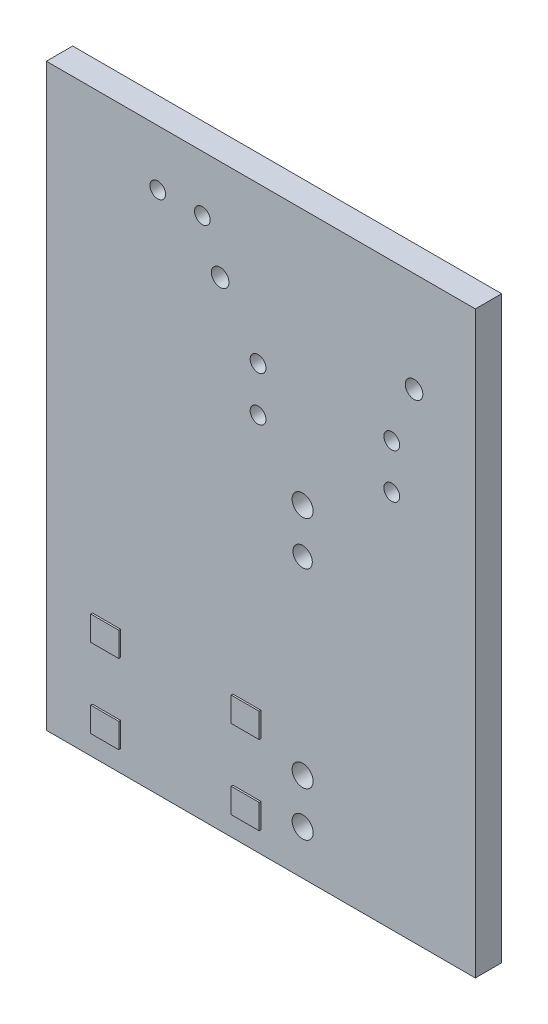
ISO-10303-21;
HEADER;
FILE_DESCRIPTION(('STEP AP214'),'2;1');
FILE_NAME('part.step','',(''),(''),'','','');
FILE_SCHEMA(('AUTOMOTIVE_DESIGN { 1 0 10303 214 1 1 1 1 }'));
ENDSEC;
DATA;
#1=APPLICATION_CONTEXT('core data for automotive mechanical design processes');
#2=APPLICATION_PROTOCOL_DEFINITION('international standard','automotive_design',2000,#1);
#3=PRODUCT_CONTEXT('',#1,'mechanical');
#4=PRODUCT('Part','Part','',(#3));
#5=PRODUCT_RELATED_PRODUCT_CATEGORY('part','',(#4));
#6=PRODUCT_DEFINITION_FORMATION('','',#4);
#7=PRODUCT_DEFINITION_CONTEXT('part definition',#1,'design');
#8=PRODUCT_DEFINITION('design','',#6,#7);
#9=PRODUCT_DEFINITION_SHAPE('','',#8);
#10=(LENGTH_UNIT() NAMED_UNIT(*) SI_UNIT(.MILLI.,.METRE.));
#11=(NAMED_UNIT(*) PLANE_ANGLE_UNIT() SI_UNIT($,.RADIAN.));
#12=(NAMED_UNIT(*) SI_UNIT($,.STERADIAN.) SOLID_ANGLE_UNIT());
#13=UNCERTAINTY_MEASURE_WITH_UNIT(LENGTH_MEASURE(1.E-05),#10,'distance_accuracy_value','');
#14=(GEOMETRIC_REPRESENTATION_CONTEXT(3) GLOBAL_UNCERTAINTY_ASSIGNED_CONTEXT((#13)) GLOBAL_UNIT_ASSIGNED_CONTEXT((#10,
#11,#12)) REPRESENTATION_CONTEXT('',''));
#15=CARTESIAN_POINT('',(0.,0.,0.));
#16=DIRECTION('',(0.,0.,1.));
#17=DIRECTION('',(1.,0.,0.));
#18=AXIS2_PLACEMENT_3D('',#15,#16,#17);
#19=CARTESIAN_POINT('',(0.,0.,1.5));
#20=DIRECTION('',(0.,0.,1.));
#21=DIRECTION('',(1.,0.,0.));
#22=AXIS2_PLACEMENT_3D('',#19,#20,#21);
#23=PLANE('',#22);
#24=CARTESIAN_POINT('',(19.685,21.59,1.5));
#25=DIRECTION('',(0.,0.,1.));
#26=DIRECTION('',(1.,0.,0.));
#27=AXIS2_PLACEMENT_3D('',#24,#25,#26);
#28=CIRCLE('',#27,0.449580000000002);
#29=CARTESIAN_POINT('',(20.13458,21.59,1.5));
#30=VERTEX_POINT('',#29);
#31=EDGE_CURVE('E314',#30,#30,#28,.T.);
#32=ORIENTED_EDGE('',*,*,#31,.F.);
#33=EDGE_LOOP('',(#32));
#34=FACE_BOUND('',#33,.T.);
#35=CARTESIAN_POINT('',(19.685,24.13,1.5));
#36=DIRECTION('',(0.,0.,1.));
#37=DIRECTION('',(1.,0.,0.));
#38=AXIS2_PLACEMENT_3D('',#35,#36,#37);
#39=CIRCLE('',#38,0.449580000000002);
#40=CARTESIAN_POINT('',(20.13458,24.13,1.5));
#41=VERTEX_POINT('',#40);
#42=EDGE_CURVE('E317',#41,#41,#39,.T.);
#43=ORIENTED_EDGE('',*,*,#42,.F.);
#44=EDGE_LOOP('',(#43));
#45=FACE_BOUND('',#44,.T.);
#46=CARTESIAN_POINT('',(12.065,24.13,1.5));
#47=DIRECTION('',(0.,0.,1.));
#48=DIRECTION('',(1.,0.,0.));
#49=AXIS2_PLACEMENT_3D('',#46,#47,#48);
#50=CIRCLE('',#49,0.44958);
#51=CARTESIAN_POINT('',(12.51458,24.13,1.5));
#52=VERTEX_POINT('',#51);
#53=EDGE_CURVE('E321',#52,#52,#50,.T.);
#54=ORIENTED_EDGE('',*,*,#53,.F.);
#55=EDGE_LOOP('',(#54));
#56=FACE_BOUND('',#55,.T.);
#57=CARTESIAN_POINT('',(12.065,21.59,1.5));
#58=DIRECTION('',(0.,0.,1.));
#59=DIRECTION('',(1.,0.,0.));
#60=AXIS2_PLACEMENT_3D('',#57,#58,#59);
#61=CIRCLE('',#60,0.44958);
#62=CARTESIAN_POINT('',(12.51458,21.59,1.5));
#63=VERTEX_POINT('',#62);
#64=EDGE_CURVE('E324',#63,#63,#61,.T.);
#65=ORIENTED_EDGE('',*,*,#64,.F.);
#66=EDGE_LOOP('',(#65));
#67=FACE_BOUND('',#66,.T.);
#68=CARTESIAN_POINT('',(14.605,15.875,1.5));
#69=DIRECTION('',(0.,0.,1.));
#70=DIRECTION('',(1.,0.,0.));
#71=AXIS2_PLACEMENT_3D('',#68,#69,#70);
#72=CIRCLE('',#71,0.55118);
#73=CARTESIAN_POINT('',(15.15618,15.875,1.5));
#74=VERTEX_POINT('',#73);
#75=EDGE_CURVE('E327',#74,#74,#72,.T.);
#76=ORIENTED_EDGE('',*,*,#75,.F.);
#77=EDGE_LOOP('',(#76));
#78=FACE_BOUND('',#77,.T.);
#79=CARTESIAN_POINT('',(14.605,18.415,1.5));
#80=DIRECTION('',(0.,0.,1.));
#81=DIRECTION('',(1.,0.,0.));
#82=AXIS2_PLACEMENT_3D('',#79,#80,#81);
#83=CIRCLE('',#82,0.59944);
#84=CARTESIAN_POINT('',(15.20444,18.415,1.5));
#85=VERTEX_POINT('',#84);
#86=EDGE_CURVE('E330',#85,#85,#83,.T.);
#87=ORIENTED_EDGE('',*,*,#86,.F.);
#88=EDGE_LOOP('',(#87));
#89=FACE_BOUND('',#88,.T.);
#90=CARTESIAN_POINT('',(14.605,2.54,1.5));
#91=DIRECTION('',(0.,0.,1.));
#92=DIRECTION('',(1.,0.,0.));
#93=AXIS2_PLACEMENT_3D('',#90,#91,#92);
#94=CIRCLE('',#93,0.59944);
#95=CARTESIAN_POINT('',(15.20444,2.54,1.5));
#96=VERTEX_POINT('',#95);
#97=EDGE_CURVE('E333',#96,#96,#94,.T.);
#98=ORIENTED_EDGE('',*,*,#97,.F.);
#99=EDGE_LOOP('',(#98));
#100=FACE_BOUND('',#99,.T.);
#101=CARTESIAN_POINT('',(14.605,5.08,1.5));
#102=DIRECTION('',(0.,0.,1.));
#103=DIRECTION('',(1.,0.,0.));
#104=AXIS2_PLACEMENT_3D('',#101,#102,#103);
#105=CIRCLE('',#104,0.59944);
#106=CARTESIAN_POINT('',(15.20444,5.08,1.5));
#107=VERTEX_POINT('',#106);
#108=EDGE_CURVE('E336',#107,#107,#105,.T.);
#109=ORIENTED_EDGE('',*,*,#108,.F.);
#110=EDGE_LOOP('',(#109));
#111=FACE_BOUND('',#110,.T.);
#112=CARTESIAN_POINT('',(9.906,27.305,1.5));
#113=DIRECTION('',(0.,0.,1.));
#114=DIRECTION('',(1.,0.,0.));
#115=AXIS2_PLACEMENT_3D('',#112,#113,#114);
#116=CIRCLE('',#115,0.50038);
#117=CARTESIAN_POINT('',(10.40638,27.305,1.5));
#118=VERTEX_POINT('',#117);
#119=EDGE_CURVE('E339',#118,#118,#116,.T.);
#120=ORIENTED_EDGE('',*,*,#119,.F.);
#121=EDGE_LOOP('',(#120));
#122=FACE_BOUND('',#121,.T.);
#123=CARTESIAN_POINT('',(20.955,27.305,1.5));
#124=DIRECTION('',(0.,0.,1.));
#125=DIRECTION('',(1.,0.,0.));
#126=AXIS2_PLACEMENT_3D('',#123,#124,#125);
#127=CIRCLE('',#126,0.500379999999998);
#128=CARTESIAN_POINT('',(21.45538,27.305,1.5));
#129=VERTEX_POINT('',#128);
#130=EDGE_CURVE('E342',#129,#129,#127,.T.);
#131=ORIENTED_EDGE('',*,*,#130,.F.);
#132=EDGE_LOOP('',(#131));
#133=FACE_BOUND('',#132,.T.);
#134=CARTESIAN_POINT('',(8.89,29.845,1.5));
#135=DIRECTION('',(0.,0.,1.));
#136=DIRECTION('',(1.,0.,0.));
#137=AXIS2_PLACEMENT_3D('',#134,#135,#136);
#138=CIRCLE('',#137,0.4445);
#139=CARTESIAN_POINT('',(9.3345,29.845,1.5));
#140=VERTEX_POINT('',#139);
#141=EDGE_CURVE('E345',#140,#140,#138,.T.);
#142=ORIENTED_EDGE('',*,*,#141,.F.);
#143=EDGE_LOOP('',(#142));
#144=FACE_BOUND('',#143,.T.);
#145=CARTESIAN_POINT('',(6.35,29.845,1.5));
#146=DIRECTION('',(0.,0.,1.));
#147=DIRECTION('',(1.,0.,0.));
#148=AXIS2_PLACEMENT_3D('',#145,#146,#147);
#149=CIRCLE('',#148,0.4445);
#150=CARTESIAN_POINT('',(6.7945,29.845,1.5));
#151=VERTEX_POINT('',#150);
#152=EDGE_CURVE('E348',#151,#151,#149,.T.);
#153=ORIENTED_EDGE('',*,*,#152,.F.);
#154=EDGE_LOOP('',(#153));
#155=FACE_BOUND('',#154,.T.);
#156=DIRECTION('',(-1.,0.,0.));
#157=VECTOR('',#156,1.);
#158=CARTESIAN_POINT('',(0.,33.02,1.5));
#159=LINE('',#158,#157);
#160=CARTESIAN_POINT('',(24.4475,33.02,1.5));
#161=VERTEX_POINT('',#160);
#162=CARTESIAN_POINT('',(0.,33.02,1.5));
#163=VERTEX_POINT('',#162);
#164=EDGE_CURVE('E351',#161,#163,#159,.T.);
#165=ORIENTED_EDGE('',*,*,#164,.T.);
#166=DIRECTION('',(0.,-1.,0.));
#167=VECTOR('',#166,1.);
#168=CARTESIAN_POINT('',(0.,0.,1.5));
#169=LINE('',#168,#167);
#170=CARTESIAN_POINT('',(0.,0.,1.5));
#171=VERTEX_POINT('',#170);
#172=EDGE_CURVE('E354',#163,#171,#169,.T.);
#173=ORIENTED_EDGE('',*,*,#172,.T.);
#174=DIRECTION('',(1.,0.,0.));
#175=VECTOR('',#174,1.);
#176=CARTESIAN_POINT('',(0.,0.,1.5));
#177=LINE('',#176,#175);
#178=CARTESIAN_POINT('',(24.4475,0.,1.5));
#179=VERTEX_POINT('',#178);
#180=EDGE_CURVE('E356',#171,#179,#177,.T.);
#181=ORIENTED_EDGE('',*,*,#180,.T.);
#182=DIRECTION('',(0.,1.,0.));
#183=VECTOR('',#182,1.);
#184=CARTESIAN_POINT('',(24.4475,0.,1.5));
#185=LINE('',#184,#183);
#186=EDGE_CURVE('E358',#179,#161,#185,.T.);
#187=ORIENTED_EDGE('',*,*,#186,.T.);
#188=EDGE_LOOP('',(#165,#173,#181,#187));
#189=FACE_BOUND('',#188,.T.);
#190=DIRECTION('',(1.,0.,0.));
#191=VECTOR('',#190,1.);
#192=CARTESIAN_POINT('',(2.6289,1.20396,1.5));
#193=LINE('',#192,#191);
#194=CARTESIAN_POINT('',(2.6289,1.20396,1.5));
#195=VERTEX_POINT('',#194);
#196=CARTESIAN_POINT('',(4.2291,1.20396,1.5));
#197=VERTEX_POINT('',#196);
#198=EDGE_CURVE('E296',#195,#197,#193,.T.);
#199=ORIENTED_EDGE('',*,*,#198,.F.);
#200=DIRECTION('',(0.,-1.,0.));
#201=VECTOR('',#200,1.);
#202=CARTESIAN_POINT('',(2.6289,2.60604,1.5));
#203=LINE('',#202,#201);
#204=CARTESIAN_POINT('',(2.6289,2.60604,1.5));
#205=VERTEX_POINT('',#204);
#206=EDGE_CURVE('E271',#205,#195,#203,.T.);
#207=ORIENTED_EDGE('',*,*,#206,.F.);
#208=DIRECTION('',(1.,0.,0.));
#209=VECTOR('',#208,1.);
#210=CARTESIAN_POINT('',(2.6289,2.60604,1.5));
#211=LINE('',#210,#209);
#212=CARTESIAN_POINT('',(4.2291,2.60604,1.5));
#213=VERTEX_POINT('',#212);
#214=EDGE_CURVE('E285',#205,#213,#211,.T.);
#215=ORIENTED_EDGE('',*,*,#214,.T.);
#216=DIRECTION('',(0.,-1.,0.));
#217=VECTOR('',#216,1.);
#218=CARTESIAN_POINT('',(4.2291,2.60604,1.5));
#219=LINE('',#218,#217);
#220=EDGE_CURVE('E299',#213,#197,#219,.T.);
#221=ORIENTED_EDGE('',*,*,#220,.T.);
#222=EDGE_LOOP('',(#199,#207,#215,#221));
#223=FACE_BOUND('',#222,.T.);
#224=DIRECTION('',(1.,0.,0.));
#225=VECTOR('',#224,1.);
#226=CARTESIAN_POINT('',(2.6289,5.70484,1.5));
#227=LINE('',#226,#225);
#228=CARTESIAN_POINT('',(2.6289,5.70484,1.5));
#229=VERTEX_POINT('',#228);
#230=CARTESIAN_POINT('',(4.2291,5.70484,1.5));
#231=VERTEX_POINT('',#230);
#232=EDGE_CURVE('E265',#229,#231,#227,.T.);
#233=ORIENTED_EDGE('',*,*,#232,.F.);
#234=DIRECTION('',(0.,-1.,0.));
#235=VECTOR('',#234,1.);
#236=CARTESIAN_POINT('',(2.6289,7.10438,1.5));
#237=LINE('',#236,#235);
#238=CARTESIAN_POINT('',(2.6289,7.10438,1.5));
#239=VERTEX_POINT('',#238);
#240=EDGE_CURVE('E268',#239,#229,#237,.T.);
#241=ORIENTED_EDGE('',*,*,#240,.F.);
#242=DIRECTION('',(1.,0.,0.));
#243=VECTOR('',#242,1.);
#244=CARTESIAN_POINT('',(2.6289,7.10438,1.5));
#245=LINE('',#244,#243);
#246=CARTESIAN_POINT('',(4.2291,7.10438,1.5));
#247=VERTEX_POINT('',#246);
#248=EDGE_CURVE('E260',#239,#247,#245,.T.);
#249=ORIENTED_EDGE('',*,*,#248,.T.);
#250=DIRECTION('',(0.,-1.,0.));
#251=VECTOR('',#250,1.);
#252=CARTESIAN_POINT('',(4.2291,7.10438,1.5));
#253=LINE('',#252,#251);
#254=EDGE_CURVE('E262',#247,#231,#253,.T.);
#255=ORIENTED_EDGE('',*,*,#254,.T.);
#256=EDGE_LOOP('',(#233,#241,#249,#255));
#257=FACE_BOUND('',#256,.T.);
#258=DIRECTION('',(1.,0.,0.));
#259=VECTOR('',#258,1.);
#260=CARTESIAN_POINT('',(10.6299,5.70484,1.5));
#261=LINE('',#260,#259);
#262=CARTESIAN_POINT('',(10.6299,5.70484,1.5));
#263=VERTEX_POINT('',#262);
#264=CARTESIAN_POINT('',(12.2301,5.70484,1.5));
#265=VERTEX_POINT('',#264);
#266=EDGE_CURVE('E232',#263,#265,#261,.T.);
#267=ORIENTED_EDGE('',*,*,#266,.F.);
#268=DIRECTION('',(0.,-1.,0.));
#269=VECTOR('',#268,1.);
#270=CARTESIAN_POINT('',(10.6299,7.10438,1.5));
#271=LINE('',#270,#269);
#272=CARTESIAN_POINT('',(10.6299,7.10438,1.5));
#273=VERTEX_POINT('',#272);
#274=EDGE_CURVE('E235',#273,#263,#271,.T.);
#275=ORIENTED_EDGE('',*,*,#274,.F.);
#276=DIRECTION('',(1.,0.,0.));
#277=VECTOR('',#276,1.);
#278=CARTESIAN_POINT('',(10.6299,7.10438,1.5));
#279=LINE('',#278,#277);
#280=CARTESIAN_POINT('',(12.2301,7.10438,1.5));
#281=VERTEX_POINT('',#280);
#282=EDGE_CURVE('E227',#273,#281,#279,.T.);
#283=ORIENTED_EDGE('',*,*,#282,.T.);
#284=DIRECTION('',(0.,-1.,0.));
#285=VECTOR('',#284,1.);
#286=CARTESIAN_POINT('',(12.2301,7.10438,1.5));
#287=LINE('',#286,#285);
#288=EDGE_CURVE('E229',#281,#265,#287,.T.);
#289=ORIENTED_EDGE('',*,*,#288,.T.);
#290=EDGE_LOOP('',(#267,#275,#283,#289));
#291=FACE_BOUND('',#290,.T.);
#292=DIRECTION('',(1.,0.,0.));
#293=VECTOR('',#292,1.);
#294=CARTESIAN_POINT('',(10.6299,1.20396,1.5));
#295=LINE('',#294,#293);
#296=CARTESIAN_POINT('',(10.6299,1.20396,1.5));
#297=VERTEX_POINT('',#296);
#298=CARTESIAN_POINT('',(12.2301,1.20396,1.5));
#299=VERTEX_POINT('',#298);
#300=EDGE_CURVE('E63',#297,#299,#295,.T.);
#301=ORIENTED_EDGE('',*,*,#300,.F.);
#302=DIRECTION('',(0.,-1.,0.));
#303=VECTOR('',#302,1.);
#304=CARTESIAN_POINT('',(10.6299,2.60604,1.5));
#305=LINE('',#304,#303);
#306=CARTESIAN_POINT('',(10.6299,2.60604,1.5));
#307=VERTEX_POINT('',#306);
#308=EDGE_CURVE('E182',#307,#297,#305,.T.);
#309=ORIENTED_EDGE('',*,*,#308,.F.);
#310=DIRECTION('',(1.,0.,0.));
#311=VECTOR('',#310,1.);
#312=CARTESIAN_POINT('',(10.6299,2.60604,1.5));
#313=LINE('',#312,#311);
#314=CARTESIAN_POINT('',(12.2301,2.60604,1.5));
#315=VERTEX_POINT('',#314);
#316=EDGE_CURVE('E185',#307,#315,#313,.T.);
#317=ORIENTED_EDGE('',*,*,#316,.T.);
#318=DIRECTION('',(0.,-1.,0.));
#319=VECTOR('',#318,1.);
#320=CARTESIAN_POINT('',(12.2301,2.60604,1.5));
#321=LINE('',#320,#319);
#322=EDGE_CURVE('E68',#315,#299,#321,.T.);
#323=ORIENTED_EDGE('',*,*,#322,.T.);
#324=EDGE_LOOP('',(#301,#309,#317,#323));
#325=FACE_BOUND('',#324,.T.);
#326=ADVANCED_FACE('F48',(#34,#45,#56,#67,#78,#89,#100,#111,#122,#133,#144,#155,#189,#223,#257,
#291,#325),#23,.T.);
#327=CARTESIAN_POINT('',(0.,33.02,1.5));
#328=DIRECTION('',(0.,-1.,0.));
#329=DIRECTION('',(0.,0.,-1.));
#330=AXIS2_PLACEMENT_3D('',#327,#328,#329);
#331=PLANE('',#330);
#332=DIRECTION('',(-1.,0.,0.));
#333=VECTOR('',#332,1.);
#334=CARTESIAN_POINT('',(0.,33.02,0.));
#335=LINE('',#334,#333);
#336=CARTESIAN_POINT('',(24.4475,33.02,0.));
#337=VERTEX_POINT('',#336);
#338=CARTESIAN_POINT('',(0.,33.02,0.));
#339=VERTEX_POINT('',#338);
#340=EDGE_CURVE('E396',#337,#339,#335,.T.);
#341=ORIENTED_EDGE('',*,*,#340,.T.);
#342=DIRECTION('',(0.,0.,-1.));
#343=VECTOR('',#342,1.);
#344=CARTESIAN_POINT('',(0.,33.02,1.5));
#345=LINE('',#344,#343);
#346=EDGE_CURVE('E13',#163,#339,#345,.T.);
#347=ORIENTED_EDGE('',*,*,#346,.F.);
#348=ORIENTED_EDGE('',*,*,#164,.F.);
#349=DIRECTION('',(0.,0.,-1.));
#350=VECTOR('',#349,1.);
#351=CARTESIAN_POINT('',(24.4475,33.02,1.5));
#352=LINE('',#351,#350);
#353=EDGE_CURVE('E360',#161,#337,#352,.T.);
#354=ORIENTED_EDGE('',*,*,#353,.T.);
#355=EDGE_LOOP('',(#341,#347,#348,#354));
#356=FACE_BOUND('',#355,.T.);
#357=ADVANCED_FACE('F426',(#356),#331,.F.);
#358=CARTESIAN_POINT('',(0.,0.,1.5));
#359=DIRECTION('',(1.,0.,0.));
#360=DIRECTION('',(0.,0.,-1.));
#361=AXIS2_PLACEMENT_3D('',#358,#359,#360);
#362=PLANE('',#361);
#363=DIRECTION('',(0.,-1.,0.));
#364=VECTOR('',#363,1.);
#365=CARTESIAN_POINT('',(0.,0.,0.));
#366=LINE('',#365,#364);
#367=CARTESIAN_POINT('',(0.,0.,0.));
#368=VERTEX_POINT('',#367);
#369=EDGE_CURVE('E399',#339,#368,#366,.T.);
#370=ORIENTED_EDGE('',*,*,#369,.T.);
#371=DIRECTION('',(0.,0.,-1.));
#372=VECTOR('',#371,1.);
#373=CARTESIAN_POINT('',(0.,0.,1.5));
#374=LINE('',#373,#372);
#375=EDGE_CURVE('E56',#171,#368,#374,.T.);
#376=ORIENTED_EDGE('',*,*,#375,.F.);
#377=ORIENTED_EDGE('',*,*,#172,.F.);
#378=ORIENTED_EDGE('',*,*,#346,.T.);
#379=EDGE_LOOP('',(#370,#376,#377,#378));
#380=FACE_BOUND('',#379,.T.);
#381=ADVANCED_FACE('F430',(#380),#362,.F.);
#382=CARTESIAN_POINT('',(0.,0.,1.5));
#383=DIRECTION('',(0.,1.,0.));
#384=DIRECTION('',(0.,0.,1.));
#385=AXIS2_PLACEMENT_3D('',#382,#383,#384);
#386=PLANE('',#385);
#387=DIRECTION('',(1.,0.,0.));
#388=VECTOR('',#387,1.);
#389=CARTESIAN_POINT('',(0.,0.,0.));
#390=LINE('',#389,#388);
#391=CARTESIAN_POINT('',(24.4475,0.,0.));
#392=VERTEX_POINT('',#391);
#393=EDGE_CURVE('E401',#368,#392,#390,.T.);
#394=ORIENTED_EDGE('',*,*,#393,.T.);
#395=DIRECTION('',(0.,0.,-1.));
#396=VECTOR('',#395,1.);
#397=CARTESIAN_POINT('',(24.4475,0.,1.5));
#398=LINE('',#397,#396);
#399=EDGE_CURVE('E406',#179,#392,#398,.T.);
#400=ORIENTED_EDGE('',*,*,#399,.F.);
#401=ORIENTED_EDGE('',*,*,#180,.F.);
#402=ORIENTED_EDGE('',*,*,#375,.T.);
#403=EDGE_LOOP('',(#394,#400,#401,#402));
#404=FACE_BOUND('',#403,.T.);
#405=ADVANCED_FACE('F413',(#404),#386,.F.);
#406=CARTESIAN_POINT('',(6.35,29.845,1.5));
#407=DIRECTION('',(0.,0.,-1.));
#408=DIRECTION('',(-1.,0.,0.));
#409=AXIS2_PLACEMENT_3D('',#406,#407,#408);
#410=CYLINDRICAL_SURFACE('',#409,0.4445);
#411=ORIENTED_EDGE('',*,*,#152,.T.);
#412=EDGE_LOOP('',(#411));
#413=FACE_BOUND('',#412,.T.);
#414=CARTESIAN_POINT('',(6.35,29.845,0.));
#415=DIRECTION('',(0.,0.,1.));
#416=DIRECTION('',(1.,0.,0.));
#417=AXIS2_PLACEMENT_3D('',#414,#415,#416);
#418=CIRCLE('',#417,0.4445);
#419=CARTESIAN_POINT('',(6.7945,29.845,0.));
#420=VERTEX_POINT('',#419);
#421=EDGE_CURVE('E393',#420,#420,#418,.T.);
#422=ORIENTED_EDGE('',*,*,#421,.F.);
#423=EDGE_LOOP('',(#422));
#424=FACE_BOUND('',#423,.T.);
#425=ADVANCED_FACE('F437',(#413,#424),#410,.F.);
#426=CARTESIAN_POINT('',(8.89,29.845,1.5));
#427=DIRECTION('',(0.,0.,-1.));
#428=DIRECTION('',(-1.,0.,0.));
#429=AXIS2_PLACEMENT_3D('',#426,#427,#428);
#430=CYLINDRICAL_SURFACE('',#429,0.4445);
#431=ORIENTED_EDGE('',*,*,#141,.T.);
#432=EDGE_LOOP('',(#431));
#433=FACE_BOUND('',#432,.T.);
#434=CARTESIAN_POINT('',(8.89,29.845,0.));
#435=DIRECTION('',(0.,0.,1.));
#436=DIRECTION('',(1.,0.,0.));
#437=AXIS2_PLACEMENT_3D('',#434,#435,#436);
#438=CIRCLE('',#437,0.4445);
#439=CARTESIAN_POINT('',(9.3345,29.845,0.));
#440=VERTEX_POINT('',#439);
#441=EDGE_CURVE('E390',#440,#440,#438,.T.);
#442=ORIENTED_EDGE('',*,*,#441,.F.);
#443=EDGE_LOOP('',(#442));
#444=FACE_BOUND('',#443,.T.);
#445=ADVANCED_FACE('F491',(#433,#444),#430,.F.);
#446=CARTESIAN_POINT('',(20.955,27.305,1.5));
#447=DIRECTION('',(0.,0.,-1.));
#448=DIRECTION('',(-1.,0.,0.));
#449=AXIS2_PLACEMENT_3D('',#446,#447,#448);
#450=CYLINDRICAL_SURFACE('',#449,0.500379999999998);
#451=ORIENTED_EDGE('',*,*,#130,.T.);
#452=EDGE_LOOP('',(#451));
#453=FACE_BOUND('',#452,.T.);
#454=CARTESIAN_POINT('',(20.955,27.305,0.));
#455=DIRECTION('',(0.,0.,1.));
#456=DIRECTION('',(1.,0.,0.));
#457=AXIS2_PLACEMENT_3D('',#454,#455,#456);
#458=CIRCLE('',#457,0.500379999999998);
#459=CARTESIAN_POINT('',(21.45538,27.305,0.));
#460=VERTEX_POINT('',#459);
#461=EDGE_CURVE('E387',#460,#460,#458,.T.);
#462=ORIENTED_EDGE('',*,*,#461,.F.);
#463=EDGE_LOOP('',(#462));
#464=FACE_BOUND('',#463,.T.);
#465=ADVANCED_FACE('F497',(#453,#464),#450,.F.);
#466=CARTESIAN_POINT('',(9.906,27.305,1.5));
#467=DIRECTION('',(0.,0.,-1.));
#468=DIRECTION('',(-1.,0.,0.));
#469=AXIS2_PLACEMENT_3D('',#466,#467,#468);
#470=CYLINDRICAL_SURFACE('',#469,0.50038);
#471=ORIENTED_EDGE('',*,*,#119,.T.);
#472=EDGE_LOOP('',(#471));
#473=FACE_BOUND('',#472,.T.);
#474=CARTESIAN_POINT('',(9.906,27.305,0.));
#475=DIRECTION('',(0.,0.,1.));
#476=DIRECTION('',(1.,0.,0.));
#477=AXIS2_PLACEMENT_3D('',#474,#475,#476);
#478=CIRCLE('',#477,0.50038);
#479=CARTESIAN_POINT('',(10.40638,27.305,0.));
#480=VERTEX_POINT('',#479);
#481=EDGE_CURVE('E384',#480,#480,#478,.T.);
#482=ORIENTED_EDGE('',*,*,#481,.F.);
#483=EDGE_LOOP('',(#482));
#484=FACE_BOUND('',#483,.T.);
#485=ADVANCED_FACE('F503',(#473,#484),#470,.F.);
#486=CARTESIAN_POINT('',(14.605,5.08,1.5));
#487=DIRECTION('',(0.,0.,-1.));
#488=DIRECTION('',(-1.,0.,0.));
#489=AXIS2_PLACEMENT_3D('',#486,#487,#488);
#490=CYLINDRICAL_SURFACE('',#489,0.59944);
#491=ORIENTED_EDGE('',*,*,#108,.T.);
#492=EDGE_LOOP('',(#491));
#493=FACE_BOUND('',#492,.T.);
#494=CARTESIAN_POINT('',(14.605,5.08,0.));
#495=DIRECTION('',(0.,0.,1.));
#496=DIRECTION('',(1.,0.,0.));
#497=AXIS2_PLACEMENT_3D('',#494,#495,#496);
#498=CIRCLE('',#497,0.59944);
#499=CARTESIAN_POINT('',(15.20444,5.08,0.));
#500=VERTEX_POINT('',#499);
#501=EDGE_CURVE('E381',#500,#500,#498,.T.);
#502=ORIENTED_EDGE('',*,*,#501,.F.);
#503=EDGE_LOOP('',(#502));
#504=FACE_BOUND('',#503,.T.);
#505=ADVANCED_FACE('F507',(#493,#504),#490,.F.);
#506=CARTESIAN_POINT('',(14.605,2.54,1.5));
#507=DIRECTION('',(0.,0.,-1.));
#508=DIRECTION('',(-1.,0.,0.));
#509=AXIS2_PLACEMENT_3D('',#506,#507,#508);
#510=CYLINDRICAL_SURFACE('',#509,0.59944);
#511=ORIENTED_EDGE('',*,*,#97,.T.);
#512=EDGE_LOOP('',(#511));
#513=FACE_BOUND('',#512,.T.);
#514=CARTESIAN_POINT('',(14.605,2.54,0.));
#515=DIRECTION('',(0.,0.,1.));
#516=DIRECTION('',(1.,0.,0.));
#517=AXIS2_PLACEMENT_3D('',#514,#515,#516);
#518=CIRCLE('',#517,0.59944);
#519=CARTESIAN_POINT('',(15.20444,2.54,0.));
#520=VERTEX_POINT('',#519);
#521=EDGE_CURVE('E378',#520,#520,#518,.T.);
#522=ORIENTED_EDGE('',*,*,#521,.F.);
#523=EDGE_LOOP('',(#522));
#524=FACE_BOUND('',#523,.T.);
#525=ADVANCED_FACE('F511',(#513,#524),#510,.F.);
#526=CARTESIAN_POINT('',(14.605,18.415,1.5));
#527=DIRECTION('',(0.,0.,-1.));
#528=DIRECTION('',(-1.,0.,0.));
#529=AXIS2_PLACEMENT_3D('',#526,#527,#528);
#530=CYLINDRICAL_SURFACE('',#529,0.59944);
#531=ORIENTED_EDGE('',*,*,#86,.T.);
#532=EDGE_LOOP('',(#531));
#533=FACE_BOUND('',#532,.T.);
#534=CARTESIAN_POINT('',(14.605,18.415,0.));
#535=DIRECTION('',(0.,0.,1.));
#536=DIRECTION('',(1.,0.,0.));
#537=AXIS2_PLACEMENT_3D('',#534,#535,#536);
#538=CIRCLE('',#537,0.59944);
#539=CARTESIAN_POINT('',(15.20444,18.415,0.));
#540=VERTEX_POINT('',#539);
#541=EDGE_CURVE('E375',#540,#540,#538,.T.);
#542=ORIENTED_EDGE('',*,*,#541,.F.);
#543=EDGE_LOOP('',(#542));
#544=FACE_BOUND('',#543,.T.);
#545=ADVANCED_FACE('F515',(#533,#544),#530,.F.);
#546=CARTESIAN_POINT('',(14.605,15.875,1.5));
#547=DIRECTION('',(0.,0.,-1.));
#548=DIRECTION('',(-1.,0.,0.));
#549=AXIS2_PLACEMENT_3D('',#546,#547,#548);
#550=CYLINDRICAL_SURFACE('',#549,0.55118);
#551=ORIENTED_EDGE('',*,*,#75,.T.);
#552=EDGE_LOOP('',(#551));
#553=FACE_BOUND('',#552,.T.);
#554=CARTESIAN_POINT('',(14.605,15.875,0.));
#555=DIRECTION('',(0.,0.,1.));
#556=DIRECTION('',(1.,0.,0.));
#557=AXIS2_PLACEMENT_3D('',#554,#555,#556);
#558=CIRCLE('',#557,0.55118);
#559=CARTESIAN_POINT('',(15.15618,15.875,0.));
#560=VERTEX_POINT('',#559);
#561=EDGE_CURVE('E372',#560,#560,#558,.T.);
#562=ORIENTED_EDGE('',*,*,#561,.F.);
#563=EDGE_LOOP('',(#562));
#564=FACE_BOUND('',#563,.T.);
#565=ADVANCED_FACE('F519',(#553,#564),#550,.F.);
#566=CARTESIAN_POINT('',(12.065,21.59,1.5));
#567=DIRECTION('',(0.,0.,-1.));
#568=DIRECTION('',(-1.,0.,0.));
#569=AXIS2_PLACEMENT_3D('',#566,#567,#568);
#570=CYLINDRICAL_SURFACE('',#569,0.44958);
#571=ORIENTED_EDGE('',*,*,#64,.T.);
#572=EDGE_LOOP('',(#571));
#573=FACE_BOUND('',#572,.T.);
#574=CARTESIAN_POINT('',(12.065,21.59,0.));
#575=DIRECTION('',(0.,0.,1.));
#576=DIRECTION('',(1.,0.,0.));
#577=AXIS2_PLACEMENT_3D('',#574,#575,#576);
#578=CIRCLE('',#577,0.44958);
#579=CARTESIAN_POINT('',(12.51458,21.59,0.));
#580=VERTEX_POINT('',#579);
#581=EDGE_CURVE('E369',#580,#580,#578,.T.);
#582=ORIENTED_EDGE('',*,*,#581,.F.);
#583=EDGE_LOOP('',(#582));
#584=FACE_BOUND('',#583,.T.);
#585=ADVANCED_FACE('F523',(#573,#584),#570,.F.);
#586=CARTESIAN_POINT('',(12.065,24.13,1.5));
#587=DIRECTION('',(0.,0.,-1.));
#588=DIRECTION('',(-1.,0.,0.));
#589=AXIS2_PLACEMENT_3D('',#586,#587,#588);
#590=CYLINDRICAL_SURFACE('',#589,0.44958);
#591=ORIENTED_EDGE('',*,*,#53,.T.);
#592=EDGE_LOOP('',(#591));
#593=FACE_BOUND('',#592,.T.);
#594=CARTESIAN_POINT('',(12.065,24.13,0.));
#595=DIRECTION('',(0.,0.,1.));
#596=DIRECTION('',(1.,0.,0.));
#597=AXIS2_PLACEMENT_3D('',#594,#595,#596);
#598=CIRCLE('',#597,0.44958);
#599=CARTESIAN_POINT('',(12.51458,24.13,0.));
#600=VERTEX_POINT('',#599);
#601=EDGE_CURVE('E366',#600,#600,#598,.T.);
#602=ORIENTED_EDGE('',*,*,#601,.F.);
#603=EDGE_LOOP('',(#602));
#604=FACE_BOUND('',#603,.T.);
#605=ADVANCED_FACE('F463',(#593,#604),#590,.F.);
#606=CARTESIAN_POINT('',(19.685,24.13,1.5));
#607=DIRECTION('',(0.,0.,-1.));
#608=DIRECTION('',(-1.,0.,0.));
#609=AXIS2_PLACEMENT_3D('',#606,#607,#608);
#610=CYLINDRICAL_SURFACE('',#609,0.449580000000002);
#611=ORIENTED_EDGE('',*,*,#42,.T.);
#612=EDGE_LOOP('',(#611));
#613=FACE_BOUND('',#612,.T.);
#614=CARTESIAN_POINT('',(19.685,24.13,0.));
#615=DIRECTION('',(0.,0.,1.));
#616=DIRECTION('',(1.,0.,0.));
#617=AXIS2_PLACEMENT_3D('',#614,#615,#616);
#618=CIRCLE('',#617,0.449580000000002);
#619=CARTESIAN_POINT('',(20.13458,24.13,0.));
#620=VERTEX_POINT('',#619);
#621=EDGE_CURVE('E363',#620,#620,#618,.T.);
#622=ORIENTED_EDGE('',*,*,#621,.F.);
#623=EDGE_LOOP('',(#622));
#624=FACE_BOUND('',#623,.T.);
#625=ADVANCED_FACE('F458',(#613,#624),#610,.F.);
#626=CARTESIAN_POINT('',(19.685,21.59,1.5));
#627=DIRECTION('',(0.,0.,-1.));
#628=DIRECTION('',(-1.,0.,0.));
#629=AXIS2_PLACEMENT_3D('',#626,#627,#628);
#630=CYLINDRICAL_SURFACE('',#629,0.449580000000002);
#631=ORIENTED_EDGE('',*,*,#31,.T.);
#632=EDGE_LOOP('',(#631));
#633=FACE_BOUND('',#632,.T.);
#634=CARTESIAN_POINT('',(19.685,21.59,0.));
#635=DIRECTION('',(0.,0.,1.));
#636=DIRECTION('',(1.,0.,0.));
#637=AXIS2_PLACEMENT_3D('',#634,#635,#636);
#638=CIRCLE('',#637,0.449580000000002);
#639=CARTESIAN_POINT('',(20.13458,21.59,0.));
#640=VERTEX_POINT('',#639);
#641=EDGE_CURVE('E313',#640,#640,#638,.T.);
#642=ORIENTED_EDGE('',*,*,#641,.F.);
#643=EDGE_LOOP('',(#642));
#644=FACE_BOUND('',#643,.T.);
#645=ADVANCED_FACE('F50',(#633,#644),#630,.F.);
#646=CARTESIAN_POINT('',(24.4475,0.,1.5));
#647=DIRECTION('',(-1.,0.,0.));
#648=DIRECTION('',(0.,0.,1.));
#649=AXIS2_PLACEMENT_3D('',#646,#647,#648);
#650=PLANE('',#649);
#651=DIRECTION('',(0.,1.,0.));
#652=VECTOR('',#651,1.);
#653=CARTESIAN_POINT('',(24.4475,0.,0.));
#654=LINE('',#653,#652);
#655=EDGE_CURVE('E318',#392,#337,#654,.T.);
#656=ORIENTED_EDGE('',*,*,#655,.T.);
#657=ORIENTED_EDGE('',*,*,#353,.F.);
#658=ORIENTED_EDGE('',*,*,#186,.F.);
#659=ORIENTED_EDGE('',*,*,#399,.T.);
#660=EDGE_LOOP('',(#656,#657,#658,#659));
#661=FACE_BOUND('',#660,.T.);
#662=ADVANCED_FACE('F422',(#661),#650,.F.);
#663=CARTESIAN_POINT('',(0.,0.,0.));
#664=DIRECTION('',(0.,0.,1.));
#665=DIRECTION('',(1.,0.,0.));
#666=AXIS2_PLACEMENT_3D('',#663,#664,#665);
#667=PLANE('',#666);
#668=ORIENTED_EDGE('',*,*,#641,.T.);
#669=EDGE_LOOP('',(#668));
#670=FACE_BOUND('',#669,.T.);
#671=ORIENTED_EDGE('',*,*,#621,.T.);
#672=EDGE_LOOP('',(#671));
#673=FACE_BOUND('',#672,.T.);
#674=ORIENTED_EDGE('',*,*,#601,.T.);
#675=EDGE_LOOP('',(#674));
#676=FACE_BOUND('',#675,.T.);
#677=ORIENTED_EDGE('',*,*,#581,.T.);
#678=EDGE_LOOP('',(#677));
#679=FACE_BOUND('',#678,.T.);
#680=ORIENTED_EDGE('',*,*,#561,.T.);
#681=EDGE_LOOP('',(#680));
#682=FACE_BOUND('',#681,.T.);
#683=ORIENTED_EDGE('',*,*,#541,.T.);
#684=EDGE_LOOP('',(#683));
#685=FACE_BOUND('',#684,.T.);
#686=ORIENTED_EDGE('',*,*,#521,.T.);
#687=EDGE_LOOP('',(#686));
#688=FACE_BOUND('',#687,.T.);
#689=ORIENTED_EDGE('',*,*,#501,.T.);
#690=EDGE_LOOP('',(#689));
#691=FACE_BOUND('',#690,.T.);
#692=ORIENTED_EDGE('',*,*,#481,.T.);
#693=EDGE_LOOP('',(#692));
#694=FACE_BOUND('',#693,.T.);
#695=ORIENTED_EDGE('',*,*,#461,.T.);
#696=EDGE_LOOP('',(#695));
#697=FACE_BOUND('',#696,.T.);
#698=ORIENTED_EDGE('',*,*,#441,.T.);
#699=EDGE_LOOP('',(#698));
#700=FACE_BOUND('',#699,.T.);
#701=ORIENTED_EDGE('',*,*,#421,.T.);
#702=EDGE_LOOP('',(#701));
#703=FACE_BOUND('',#702,.T.);
#704=ORIENTED_EDGE('',*,*,#340,.F.);
#705=ORIENTED_EDGE('',*,*,#655,.F.);
#706=ORIENTED_EDGE('',*,*,#393,.F.);
#707=ORIENTED_EDGE('',*,*,#369,.F.);
#708=EDGE_LOOP('',(#704,#705,#706,#707));
#709=FACE_BOUND('',#708,.T.);
#710=ADVANCED_FACE('F419',(#670,#673,#676,#679,#682,#685,#688,#691,#694,#697,#700,#703,#709),
#667,.F.);
#711=CARTESIAN_POINT('',(2.6289,2.60604,1.6));
#712=DIRECTION('',(1.,0.,0.));
#713=DIRECTION('',(0.,0.,-1.));
#714=AXIS2_PLACEMENT_3D('',#711,#712,#713);
#715=PLANE('',#714);
#716=ORIENTED_EDGE('',*,*,#206,.T.);
#717=DIRECTION('',(0.,0.,-1.));
#718=VECTOR('',#717,1.);
#719=CARTESIAN_POINT('',(2.6289,1.20396,1.6));
#720=LINE('',#719,#718);
#721=CARTESIAN_POINT('',(2.6289,1.20396,1.6));
#722=VERTEX_POINT('',#721);
#723=EDGE_CURVE('E310',#722,#195,#720,.T.);
#724=ORIENTED_EDGE('',*,*,#723,.F.);
#725=DIRECTION('',(0.,-1.,0.));
#726=VECTOR('',#725,1.);
#727=CARTESIAN_POINT('',(2.6289,2.60604,1.6));
#728=LINE('',#727,#726);
#729=CARTESIAN_POINT('',(2.6289,2.60604,1.6));
#730=VERTEX_POINT('',#729);
#731=EDGE_CURVE('E281',#730,#722,#728,.T.);
#732=ORIENTED_EDGE('',*,*,#731,.F.);
#733=DIRECTION('',(0.,0.,-1.));
#734=VECTOR('',#733,1.);
#735=CARTESIAN_POINT('',(2.6289,2.60604,1.6));
#736=LINE('',#735,#734);
#737=EDGE_CURVE('E293',#730,#205,#736,.T.);
#738=ORIENTED_EDGE('',*,*,#737,.T.);
#739=EDGE_LOOP('',(#716,#724,#732,#738));
#740=FACE_BOUND('',#739,.T.);
#741=ADVANCED_FACE('F449',(#740),#715,.F.);
#742=CARTESIAN_POINT('',(2.6289,1.20396,1.6));
#743=DIRECTION('',(0.,1.,0.));
#744=DIRECTION('',(0.,0.,1.));
#745=AXIS2_PLACEMENT_3D('',#742,#743,#744);
#746=PLANE('',#745);
#747=ORIENTED_EDGE('',*,*,#198,.T.);
#748=DIRECTION('',(0.,0.,-1.));
#749=VECTOR('',#748,1.);
#750=CARTESIAN_POINT('',(4.2291,1.20396,1.6));
#751=LINE('',#750,#749);
#752=CARTESIAN_POINT('',(4.2291,1.20396,1.6));
#753=VERTEX_POINT('',#752);
#754=EDGE_CURVE('E307',#753,#197,#751,.T.);
#755=ORIENTED_EDGE('',*,*,#754,.F.);
#756=DIRECTION('',(1.,0.,0.));
#757=VECTOR('',#756,1.);
#758=CARTESIAN_POINT('',(2.6289,1.20396,1.6));
#759=LINE('',#758,#757);
#760=EDGE_CURVE('E284',#722,#753,#759,.T.);
#761=ORIENTED_EDGE('',*,*,#760,.F.);
#762=ORIENTED_EDGE('',*,*,#723,.T.);
#763=EDGE_LOOP('',(#747,#755,#761,#762));
#764=FACE_BOUND('',#763,.T.);
#765=ADVANCED_FACE('F596',(#764),#746,.F.);
#766=CARTESIAN_POINT('',(4.2291,2.60604,1.6));
#767=DIRECTION('',(1.,0.,0.));
#768=DIRECTION('',(0.,0.,-1.));
#769=AXIS2_PLACEMENT_3D('',#766,#767,#768);
#770=PLANE('',#769);
#771=ORIENTED_EDGE('',*,*,#220,.F.);
#772=DIRECTION('',(0.,0.,-1.));
#773=VECTOR('',#772,1.);
#774=CARTESIAN_POINT('',(4.2291,2.60604,1.6));
#775=LINE('',#774,#773);
#776=CARTESIAN_POINT('',(4.2291,2.60604,1.6));
#777=VERTEX_POINT('',#776);
#778=EDGE_CURVE('E304',#777,#213,#775,.T.);
#779=ORIENTED_EDGE('',*,*,#778,.F.);
#780=DIRECTION('',(0.,-1.,0.));
#781=VECTOR('',#780,1.);
#782=CARTESIAN_POINT('',(4.2291,2.60604,1.6));
#783=LINE('',#782,#781);
#784=EDGE_CURVE('E287',#777,#753,#783,.T.);
#785=ORIENTED_EDGE('',*,*,#784,.T.);
#786=ORIENTED_EDGE('',*,*,#754,.T.);
#787=EDGE_LOOP('',(#771,#779,#785,#786));
#788=FACE_BOUND('',#787,.T.);
#789=ADVANCED_FACE('F605',(#788),#770,.T.);
#790=CARTESIAN_POINT('',(2.6289,2.60604,1.6));
#791=DIRECTION('',(0.,1.,0.));
#792=DIRECTION('',(0.,0.,1.));
#793=AXIS2_PLACEMENT_3D('',#790,#791,#792);
#794=PLANE('',#793);
#795=ORIENTED_EDGE('',*,*,#214,.F.);
#796=ORIENTED_EDGE('',*,*,#737,.F.);
#797=DIRECTION('',(1.,0.,0.));
#798=VECTOR('',#797,1.);
#799=CARTESIAN_POINT('',(2.6289,2.60604,1.6));
#800=LINE('',#799,#798);
#801=EDGE_CURVE('E290',#730,#777,#800,.T.);
#802=ORIENTED_EDGE('',*,*,#801,.T.);
#803=ORIENTED_EDGE('',*,*,#778,.T.);
#804=EDGE_LOOP('',(#795,#796,#802,#803));
#805=FACE_BOUND('',#804,.T.);
#806=ADVANCED_FACE('F614',(#805),#794,.T.);
#807=CARTESIAN_POINT('',(0.,0.,1.6));
#808=DIRECTION('',(0.,0.,1.));
#809=DIRECTION('',(1.,0.,0.));
#810=AXIS2_PLACEMENT_3D('',#807,#808,#809);
#811=PLANE('',#810);
#812=ORIENTED_EDGE('',*,*,#731,.T.);
#813=ORIENTED_EDGE('',*,*,#760,.T.);
#814=ORIENTED_EDGE('',*,*,#784,.F.);
#815=ORIENTED_EDGE('',*,*,#801,.F.);
#816=EDGE_LOOP('',(#812,#813,#814,#815));
#817=FACE_BOUND('',#816,.T.);
#818=ADVANCED_FACE('F624',(#817),#811,.T.);
#819=CARTESIAN_POINT('',(2.6289,7.10438,1.6));
#820=DIRECTION('',(1.,0.,0.));
#821=DIRECTION('',(0.,0.,-1.));
#822=AXIS2_PLACEMENT_3D('',#819,#820,#821);
#823=PLANE('',#822);
#824=ORIENTED_EDGE('',*,*,#240,.T.);
#825=DIRECTION('',(0.,0.,-1.));
#826=VECTOR('',#825,1.);
#827=CARTESIAN_POINT('',(2.6289,5.70484,1.6));
#828=LINE('',#827,#826);
#829=CARTESIAN_POINT('',(2.6289,5.70484,1.6));
#830=VERTEX_POINT('',#829);
#831=EDGE_CURVE('E238',#830,#229,#828,.T.);
#832=ORIENTED_EDGE('',*,*,#831,.F.);
#833=DIRECTION('',(0.,-1.,0.));
#834=VECTOR('',#833,1.);
#835=CARTESIAN_POINT('',(2.6289,7.10438,1.6));
#836=LINE('',#835,#834);
#837=CARTESIAN_POINT('',(2.6289,7.10438,1.6));
#838=VERTEX_POINT('',#837);
#839=EDGE_CURVE('E263',#838,#830,#836,.T.);
#840=ORIENTED_EDGE('',*,*,#839,.F.);
#841=DIRECTION('',(0.,0.,-1.));
#842=VECTOR('',#841,1.);
#843=CARTESIAN_POINT('',(2.6289,7.10438,1.6));
#844=LINE('',#843,#842);
#845=EDGE_CURVE('E256',#838,#239,#844,.T.);
#846=ORIENTED_EDGE('',*,*,#845,.T.);
#847=EDGE_LOOP('',(#824,#832,#840,#846));
#848=FACE_BOUND('',#847,.T.);
#849=ADVANCED_FACE('F634',(#848),#823,.F.);
#850=CARTESIAN_POINT('',(2.6289,5.70484,1.6));
#851=DIRECTION('',(0.,1.,0.));
#852=DIRECTION('',(0.,0.,1.));
#853=AXIS2_PLACEMENT_3D('',#850,#851,#852);
#854=PLANE('',#853);
#855=ORIENTED_EDGE('',*,*,#232,.T.);
#856=DIRECTION('',(0.,0.,-1.));
#857=VECTOR('',#856,1.);
#858=CARTESIAN_POINT('',(4.2291,5.70484,1.6));
#859=LINE('',#858,#857);
#860=CARTESIAN_POINT('',(4.2291,5.70484,1.6));
#861=VERTEX_POINT('',#860);
#862=EDGE_CURVE('E250',#861,#231,#859,.T.);
#863=ORIENTED_EDGE('',*,*,#862,.F.);
#864=DIRECTION('',(1.,0.,0.));
#865=VECTOR('',#864,1.);
#866=CARTESIAN_POINT('',(2.6289,5.70484,1.6));
#867=LINE('',#866,#865);
#868=EDGE_CURVE('E277',#830,#861,#867,.T.);
#869=ORIENTED_EDGE('',*,*,#868,.F.);
#870=ORIENTED_EDGE('',*,*,#831,.T.);
#871=EDGE_LOOP('',(#855,#863,#869,#870));
#872=FACE_BOUND('',#871,.T.);
#873=ADVANCED_FACE('F644',(#872),#854,.F.);
#874=CARTESIAN_POINT('',(4.2291,7.10438,1.6));
#875=DIRECTION('',(1.,0.,0.));
#876=DIRECTION('',(0.,0.,-1.));
#877=AXIS2_PLACEMENT_3D('',#874,#875,#876);
#878=PLANE('',#877);
#879=ORIENTED_EDGE('',*,*,#254,.F.);
#880=DIRECTION('',(0.,0.,-1.));
#881=VECTOR('',#880,1.);
#882=CARTESIAN_POINT('',(4.2291,7.10438,1.6));
#883=LINE('',#882,#881);
#884=CARTESIAN_POINT('',(4.2291,7.10438,1.6));
#885=VERTEX_POINT('',#884);
#886=EDGE_CURVE('E253',#885,#247,#883,.T.);
#887=ORIENTED_EDGE('',*,*,#886,.F.);
#888=DIRECTION('',(0.,-1.,0.));
#889=VECTOR('',#888,1.);
#890=CARTESIAN_POINT('',(4.2291,7.10438,1.6));
#891=LINE('',#890,#889);
#892=EDGE_CURVE('E274',#885,#861,#891,.T.);
#893=ORIENTED_EDGE('',*,*,#892,.T.);
#894=ORIENTED_EDGE('',*,*,#862,.T.);
#895=EDGE_LOOP('',(#879,#887,#893,#894));
#896=FACE_BOUND('',#895,.T.);
#897=ADVANCED_FACE('F654',(#896),#878,.T.);
#898=CARTESIAN_POINT('',(2.6289,7.10438,1.6));
#899=DIRECTION('',(0.,1.,0.));
#900=DIRECTION('',(0.,0.,1.));
#901=AXIS2_PLACEMENT_3D('',#898,#899,#900);
#902=PLANE('',#901);
#903=ORIENTED_EDGE('',*,*,#248,.F.);
#904=ORIENTED_EDGE('',*,*,#845,.F.);
#905=DIRECTION('',(1.,0.,0.));
#906=VECTOR('',#905,1.);
#907=CARTESIAN_POINT('',(2.6289,7.10438,1.6));
#908=LINE('',#907,#906);
#909=EDGE_CURVE('E259',#838,#885,#908,.T.);
#910=ORIENTED_EDGE('',*,*,#909,.T.);
#911=ORIENTED_EDGE('',*,*,#886,.T.);
#912=EDGE_LOOP('',(#903,#904,#910,#911));
#913=FACE_BOUND('',#912,.T.);
#914=ADVANCED_FACE('F664',(#913),#902,.T.);
#915=CARTESIAN_POINT('',(0.,0.,1.6));
#916=DIRECTION('',(0.,0.,1.));
#917=DIRECTION('',(1.,0.,0.));
#918=AXIS2_PLACEMENT_3D('',#915,#916,#917);
#919=PLANE('',#918);
#920=ORIENTED_EDGE('',*,*,#839,.T.);
#921=ORIENTED_EDGE('',*,*,#868,.T.);
#922=ORIENTED_EDGE('',*,*,#892,.F.);
#923=ORIENTED_EDGE('',*,*,#909,.F.);
#924=EDGE_LOOP('',(#920,#921,#922,#923));
#925=FACE_BOUND('',#924,.T.);
#926=ADVANCED_FACE('F674',(#925),#919,.T.);
#927=CARTESIAN_POINT('',(10.6299,7.10438,1.6));
#928=DIRECTION('',(1.,0.,0.));
#929=DIRECTION('',(0.,0.,-1.));
#930=AXIS2_PLACEMENT_3D('',#927,#928,#929);
#931=PLANE('',#930);
#932=ORIENTED_EDGE('',*,*,#274,.T.);
#933=DIRECTION('',(0.,0.,-1.));
#934=VECTOR('',#933,1.);
#935=CARTESIAN_POINT('',(10.6299,5.70484,1.6));
#936=LINE('',#935,#934);
#937=CARTESIAN_POINT('',(10.6299,5.70484,1.6));
#938=VERTEX_POINT('',#937);
#939=EDGE_CURVE('E189',#938,#263,#936,.T.);
#940=ORIENTED_EDGE('',*,*,#939,.F.);
#941=DIRECTION('',(0.,-1.,0.));
#942=VECTOR('',#941,1.);
#943=CARTESIAN_POINT('',(10.6299,7.10438,1.6));
#944=LINE('',#943,#942);
#945=CARTESIAN_POINT('',(10.6299,7.10438,1.6));
#946=VERTEX_POINT('',#945);
#947=EDGE_CURVE('E230',#946,#938,#944,.T.);
#948=ORIENTED_EDGE('',*,*,#947,.F.);
#949=DIRECTION('',(0.,0.,-1.));
#950=VECTOR('',#949,1.);
#951=CARTESIAN_POINT('',(10.6299,7.10438,1.6));
#952=LINE('',#951,#950);
#953=EDGE_CURVE('E223',#946,#273,#952,.T.);
#954=ORIENTED_EDGE('',*,*,#953,.T.);
#955=EDGE_LOOP('',(#932,#940,#948,#954));
#956=FACE_BOUND('',#955,.T.);
#957=ADVANCED_FACE('F684',(#956),#931,.F.);
#958=CARTESIAN_POINT('',(10.6299,5.70484,1.6));
#959=DIRECTION('',(0.,1.,0.));
#960=DIRECTION('',(0.,0.,1.));
#961=AXIS2_PLACEMENT_3D('',#958,#959,#960);
#962=PLANE('',#961);
#963=ORIENTED_EDGE('',*,*,#266,.T.);
#964=DIRECTION('',(0.,0.,-1.));
#965=VECTOR('',#964,1.);
#966=CARTESIAN_POINT('',(12.2301,5.70484,1.6));
#967=LINE('',#966,#965);
#968=CARTESIAN_POINT('',(12.2301,5.70484,1.6));
#969=VERTEX_POINT('',#968);
#970=EDGE_CURVE('E217',#969,#265,#967,.T.);
#971=ORIENTED_EDGE('',*,*,#970,.F.);
#972=DIRECTION('',(1.,0.,0.));
#973=VECTOR('',#972,1.);
#974=CARTESIAN_POINT('',(10.6299,5.70484,1.6));
#975=LINE('',#974,#973);
#976=EDGE_CURVE('E244',#938,#969,#975,.T.);
#977=ORIENTED_EDGE('',*,*,#976,.F.);
#978=ORIENTED_EDGE('',*,*,#939,.T.);
#979=EDGE_LOOP('',(#963,#971,#977,#978));
#980=FACE_BOUND('',#979,.T.);
#981=ADVANCED_FACE('F694',(#980),#962,.F.);
#982=CARTESIAN_POINT('',(12.2301,7.10438,1.6));
#983=DIRECTION('',(1.,0.,0.));
#984=DIRECTION('',(0.,0.,-1.));
#985=AXIS2_PLACEMENT_3D('',#982,#983,#984);
#986=PLANE('',#985);
#987=ORIENTED_EDGE('',*,*,#288,.F.);
#988=DIRECTION('',(0.,0.,-1.));
#989=VECTOR('',#988,1.);
#990=CARTESIAN_POINT('',(12.2301,7.10438,1.6));
#991=LINE('',#990,#989);
#992=CARTESIAN_POINT('',(12.2301,7.10438,1.6));
#993=VERTEX_POINT('',#992);
#994=EDGE_CURVE('E220',#993,#281,#991,.T.);
#995=ORIENTED_EDGE('',*,*,#994,.F.);
#996=DIRECTION('',(0.,-1.,0.));
#997=VECTOR('',#996,1.);
#998=CARTESIAN_POINT('',(12.2301,7.10438,1.6));
#999=LINE('',#998,#997);
#1000=EDGE_CURVE('E241',#993,#969,#999,.T.);
#1001=ORIENTED_EDGE('',*,*,#1000,.T.);
#1002=ORIENTED_EDGE('',*,*,#970,.T.);
#1003=EDGE_LOOP('',(#987,#995,#1001,#1002));
#1004=FACE_BOUND('',#1003,.T.);
#1005=ADVANCED_FACE('F704',(#1004),#986,.T.);
#1006=CARTESIAN_POINT('',(10.6299,7.10438,1.6));
#1007=DIRECTION('',(0.,1.,0.));
#1008=DIRECTION('',(0.,0.,1.));
#1009=AXIS2_PLACEMENT_3D('',#1006,#1007,#1008);
#1010=PLANE('',#1009);
#1011=ORIENTED_EDGE('',*,*,#282,.F.);
#1012=ORIENTED_EDGE('',*,*,#953,.F.);
#1013=DIRECTION('',(1.,0.,0.));
#1014=VECTOR('',#1013,1.);
#1015=CARTESIAN_POINT('',(10.6299,7.10438,1.6));
#1016=LINE('',#1015,#1014);
#1017=EDGE_CURVE('E226',#946,#993,#1016,.T.);
#1018=ORIENTED_EDGE('',*,*,#1017,.T.);
#1019=ORIENTED_EDGE('',*,*,#994,.T.);
#1020=EDGE_LOOP('',(#1011,#1012,#1018,#1019));
#1021=FACE_BOUND('',#1020,.T.);
#1022=ADVANCED_FACE('F714',(#1021),#1010,.T.);
#1023=CARTESIAN_POINT('',(0.,0.,1.6));
#1024=DIRECTION('',(0.,0.,1.));
#1025=DIRECTION('',(1.,0.,0.));
#1026=AXIS2_PLACEMENT_3D('',#1023,#1024,#1025);
#1027=PLANE('',#1026);
#1028=ORIENTED_EDGE('',*,*,#947,.T.);
#1029=ORIENTED_EDGE('',*,*,#976,.T.);
#1030=ORIENTED_EDGE('',*,*,#1000,.F.);
#1031=ORIENTED_EDGE('',*,*,#1017,.F.);
#1032=EDGE_LOOP('',(#1028,#1029,#1030,#1031));
#1033=FACE_BOUND('',#1032,.T.);
#1034=ADVANCED_FACE('F724',(#1033),#1027,.T.);
#1035=CARTESIAN_POINT('',(10.6299,2.60604,1.6));
#1036=DIRECTION('',(1.,0.,0.));
#1037=DIRECTION('',(0.,0.,-1.));
#1038=AXIS2_PLACEMENT_3D('',#1035,#1036,#1037);
#1039=PLANE('',#1038);
#1040=ORIENTED_EDGE('',*,*,#308,.T.);
#1041=DIRECTION('',(0.,0.,-1.));
#1042=VECTOR('',#1041,1.);
#1043=CARTESIAN_POINT('',(10.6299,1.20396,1.6));
#1044=LINE('',#1043,#1042);
#1045=CARTESIAN_POINT('',(10.6299,1.20396,1.6));
#1046=VERTEX_POINT('',#1045);
#1047=EDGE_CURVE('E786',#1046,#297,#1044,.T.);
#1048=ORIENTED_EDGE('',*,*,#1047,.F.);
#1049=DIRECTION('',(0.,-1.,0.));
#1050=VECTOR('',#1049,1.);
#1051=CARTESIAN_POINT('',(10.6299,2.60604,1.6));
#1052=LINE('',#1051,#1050);
#1053=CARTESIAN_POINT('',(10.6299,2.60604,1.6));
#1054=VERTEX_POINT('',#1053);
#1055=EDGE_CURVE('E195',#1054,#1046,#1052,.T.);
#1056=ORIENTED_EDGE('',*,*,#1055,.F.);
#1057=DIRECTION('',(0.,0.,-1.));
#1058=VECTOR('',#1057,1.);
#1059=CARTESIAN_POINT('',(10.6299,2.60604,1.6));
#1060=LINE('',#1059,#1058);
#1061=EDGE_CURVE('E192',#1054,#307,#1060,.T.);
#1062=ORIENTED_EDGE('',*,*,#1061,.T.);
#1063=EDGE_LOOP('',(#1040,#1048,#1056,#1062));
#1064=FACE_BOUND('',#1063,.T.);
#1065=ADVANCED_FACE('F193',(#1064),#1039,.F.);
#1066=CARTESIAN_POINT('',(10.6299,1.20396,1.6));
#1067=DIRECTION('',(0.,1.,0.));
#1068=DIRECTION('',(0.,0.,1.));
#1069=AXIS2_PLACEMENT_3D('',#1066,#1067,#1068);
#1070=PLANE('',#1069);
#1071=ORIENTED_EDGE('',*,*,#300,.T.);
#1072=DIRECTION('',(0.,0.,-1.));
#1073=VECTOR('',#1072,1.);
#1074=CARTESIAN_POINT('',(12.2301,1.20396,1.6));
#1075=LINE('',#1074,#1073);
#1076=CARTESIAN_POINT('',(12.2301,1.20396,1.6));
#1077=VERTEX_POINT('',#1076);
#1078=EDGE_CURVE('E787',#1077,#299,#1075,.T.);
#1079=ORIENTED_EDGE('',*,*,#1078,.F.);
#1080=DIRECTION('',(1.,0.,0.));
#1081=VECTOR('',#1080,1.);
#1082=CARTESIAN_POINT('',(10.6299,1.20396,1.6));
#1083=LINE('',#1082,#1081);
#1084=EDGE_CURVE('E205',#1046,#1077,#1083,.T.);
#1085=ORIENTED_EDGE('',*,*,#1084,.F.);
#1086=ORIENTED_EDGE('',*,*,#1047,.T.);
#1087=EDGE_LOOP('',(#1071,#1079,#1085,#1086));
#1088=FACE_BOUND('',#1087,.T.);
#1089=ADVANCED_FACE('F743',(#1088),#1070,.F.);
#1090=CARTESIAN_POINT('',(12.2301,2.60604,1.6));
#1091=DIRECTION('',(1.,0.,0.));
#1092=DIRECTION('',(0.,0.,-1.));
#1093=AXIS2_PLACEMENT_3D('',#1090,#1091,#1092);
#1094=PLANE('',#1093);
#1095=ORIENTED_EDGE('',*,*,#322,.F.);
#1096=DIRECTION('',(0.,0.,-1.));
#1097=VECTOR('',#1096,1.);
#1098=CARTESIAN_POINT('',(12.2301,2.60604,1.6));
#1099=LINE('',#1098,#1097);
#1100=CARTESIAN_POINT('',(12.2301,2.60604,1.6));
#1101=VERTEX_POINT('',#1100);
#1102=EDGE_CURVE('E200',#1101,#315,#1099,.T.);
#1103=ORIENTED_EDGE('',*,*,#1102,.F.);
#1104=DIRECTION('',(0.,-1.,0.));
#1105=VECTOR('',#1104,1.);
#1106=CARTESIAN_POINT('',(12.2301,2.60604,1.6));
#1107=LINE('',#1106,#1105);
#1108=EDGE_CURVE('E211',#1101,#1077,#1107,.T.);
#1109=ORIENTED_EDGE('',*,*,#1108,.T.);
#1110=ORIENTED_EDGE('',*,*,#1078,.T.);
#1111=EDGE_LOOP('',(#1095,#1103,#1109,#1110));
#1112=FACE_BOUND('',#1111,.T.);
#1113=ADVANCED_FACE('F752',(#1112),#1094,.T.);
#1114=CARTESIAN_POINT('',(10.6299,2.60604,1.6));
#1115=DIRECTION('',(0.,1.,0.));
#1116=DIRECTION('',(0.,0.,1.));
#1117=AXIS2_PLACEMENT_3D('',#1114,#1115,#1116);
#1118=PLANE('',#1117);
#1119=ORIENTED_EDGE('',*,*,#316,.F.);
#1120=ORIENTED_EDGE('',*,*,#1061,.F.);
#1121=DIRECTION('',(1.,0.,0.));
#1122=VECTOR('',#1121,1.);
#1123=CARTESIAN_POINT('',(10.6299,2.60604,1.6));
#1124=LINE('',#1123,#1122);
#1125=EDGE_CURVE('E199',#1054,#1101,#1124,.T.);
#1126=ORIENTED_EDGE('',*,*,#1125,.T.);
#1127=ORIENTED_EDGE('',*,*,#1102,.T.);
#1128=EDGE_LOOP('',(#1119,#1120,#1126,#1127));
#1129=FACE_BOUND('',#1128,.T.);
#1130=ADVANCED_FACE('F202',(#1129),#1118,.T.);
#1131=CARTESIAN_POINT('',(0.,0.,1.6));
#1132=DIRECTION('',(0.,0.,1.));
#1133=DIRECTION('',(1.,0.,0.));
#1134=AXIS2_PLACEMENT_3D('',#1131,#1132,#1133);
#1135=PLANE('',#1134);
#1136=ORIENTED_EDGE('',*,*,#1055,.T.);
#1137=ORIENTED_EDGE('',*,*,#1084,.T.);
#1138=ORIENTED_EDGE('',*,*,#1108,.F.);
#1139=ORIENTED_EDGE('',*,*,#1125,.F.);
#1140=EDGE_LOOP('',(#1136,#1137,#1138,#1139));
#1141=FACE_BOUND('',#1140,.T.);
#1142=ADVANCED_FACE('F771',(#1141),#1135,.T.);
#1143=CLOSED_SHELL('',(#326,#357,#381,#405,#425,#445,#465,#485,#505,#525,#545,#565,#585,#605,
#625,#645,#662,#710,#741,#765,#789,#806,#818,#849,#873,#897,#914,#926,#957,#981,#1005,#1022,
#1034,#1065,#1089,#1113,#1130,#1142));
#1144=MANIFOLD_SOLID_BREP('B2',#1143);
#1145=ADVANCED_BREP_SHAPE_REPRESENTATION('',(#18,#1144),#14);
#1146=SHAPE_DEFINITION_REPRESENTATION(#9,#1145);
ENDSEC;
END-ISO-10303-21;
